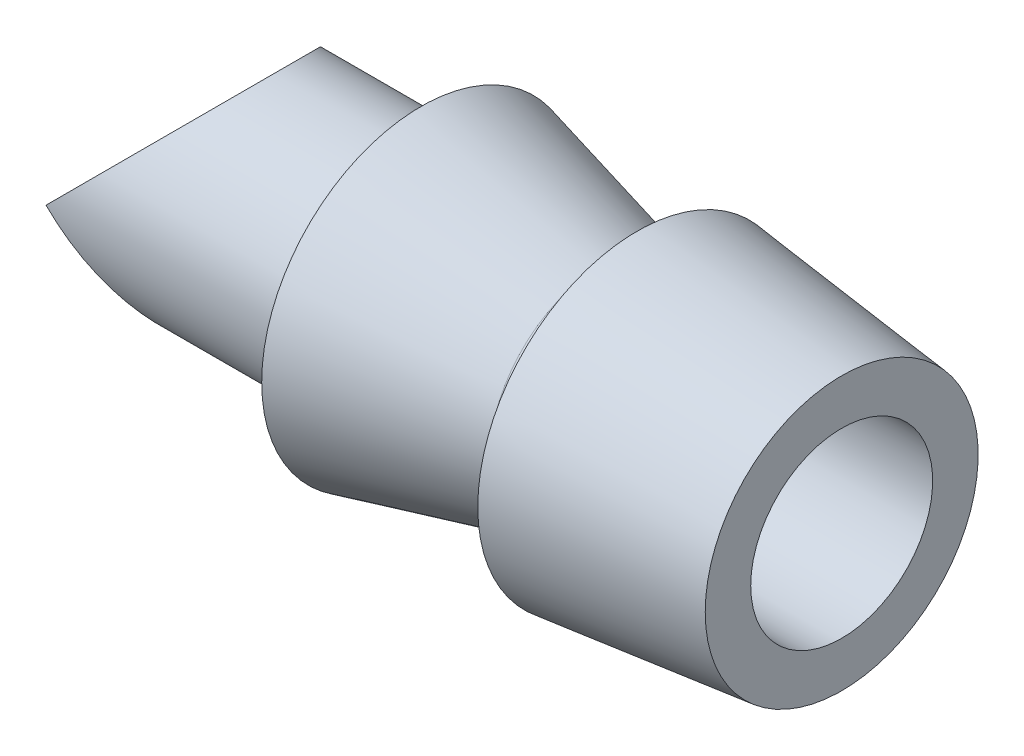
ISO-10303-21;
HEADER;
FILE_DESCRIPTION(('STEP AP214'),'2;1');
FILE_NAME('part.step','',(''),(''),'','','');
FILE_SCHEMA(('AUTOMOTIVE_DESIGN { 1 0 10303 214 1 1 1 1 }'));
ENDSEC;
DATA;
#1=APPLICATION_CONTEXT('core data for automotive mechanical design processes');
#2=APPLICATION_PROTOCOL_DEFINITION('international standard','automotive_design',2000,#1);
#3=PRODUCT_CONTEXT('',#1,'mechanical');
#4=PRODUCT('Part','Part','',(#3));
#5=PRODUCT_RELATED_PRODUCT_CATEGORY('part','',(#4));
#6=PRODUCT_DEFINITION_FORMATION('','',#4);
#7=PRODUCT_DEFINITION_CONTEXT('part definition',#1,'design');
#8=PRODUCT_DEFINITION('design','',#6,#7);
#9=PRODUCT_DEFINITION_SHAPE('','',#8);
#10=(LENGTH_UNIT() NAMED_UNIT(*) SI_UNIT(.MILLI.,.METRE.));
#11=(NAMED_UNIT(*) PLANE_ANGLE_UNIT() SI_UNIT($,.RADIAN.));
#12=(NAMED_UNIT(*) SI_UNIT($,.STERADIAN.) SOLID_ANGLE_UNIT());
#13=UNCERTAINTY_MEASURE_WITH_UNIT(LENGTH_MEASURE(1.E-05),#10,'distance_accuracy_value','');
#14=(GEOMETRIC_REPRESENTATION_CONTEXT(3) GLOBAL_UNCERTAINTY_ASSIGNED_CONTEXT((#13)) GLOBAL_UNIT_ASSIGNED_CONTEXT((#10,
#11,#12)) REPRESENTATION_CONTEXT('',''));
#15=CARTESIAN_POINT('',(0.,0.,0.));
#16=DIRECTION('',(0.,0.,1.));
#17=DIRECTION('',(1.,0.,0.));
#18=AXIS2_PLACEMENT_3D('',#15,#16,#17);
#19=CARTESIAN_POINT('',(0.,0.,0.));
#20=DIRECTION('',(-1.,0.,0.));
#21=DIRECTION('',(0.,0.,1.));
#22=AXIS2_PLACEMENT_3D('',#19,#20,#21);
#23=CYLINDRICAL_SURFACE('',#22,2.5);
#24=CARTESIAN_POINT('',(-4.35466522054894,0.,0.));
#25=DIRECTION('',(0.707106781186547,-0.707106781186547,0.));
#26=DIRECTION('',(-0.707106781186548,-0.707106781186548,0.));
#27=AXIS2_PLACEMENT_3D('',#24,#25,#26);
#28=ELLIPSE('',#27,3.53553390593274,2.5);
#29=CARTESIAN_POINT('',(-4.35466522054894,0.,-2.5));
#30=VERTEX_POINT('',#29);
#31=CARTESIAN_POINT('',(-4.35466522054894,0.,2.5));
#32=VERTEX_POINT('',#31);
#33=EDGE_CURVE('E71',#30,#32,#28,.T.);
#34=ORIENTED_EDGE('',*,*,#33,.T.);
#35=CARTESIAN_POINT('',(-4.35466522054894,0.,0.));
#36=DIRECTION('',(0.707106781186547,0.707106781186547,0.));
#37=DIRECTION('',(-0.707106781186548,0.707106781186548,0.));
#38=AXIS2_PLACEMENT_3D('',#35,#36,#37);
#39=ELLIPSE('',#38,3.53553390593274,2.5);
#40=EDGE_CURVE('E58',#32,#30,#39,.T.);
#41=ORIENTED_EDGE('',*,*,#40,.T.);
#42=EDGE_LOOP('',(#34,#41));
#43=FACE_BOUND('',#42,.T.);
#44=CARTESIAN_POINT('',(1.38699913001601,0.,0.));
#45=DIRECTION('',(-1.,0.,0.));
#46=DIRECTION('',(0.,0.,1.));
#47=AXIS2_PLACEMENT_3D('',#44,#45,#46);
#48=CIRCLE('',#47,2.5);
#49=CARTESIAN_POINT('',(1.38699913001601,0.,2.5));
#50=VERTEX_POINT('',#49);
#51=EDGE_CURVE('E51',#50,#50,#48,.T.);
#52=ORIENTED_EDGE('',*,*,#51,.T.);
#53=EDGE_LOOP('',(#52));
#54=FACE_BOUND('',#53,.T.);
#55=ADVANCED_FACE('F43',(#43,#54),#23,.T.);
#56=CARTESIAN_POINT('',(1.38699913001601,3.5,0.));
#57=DIRECTION('',(1.,0.,0.));
#58=DIRECTION('',(0.,0.,-1.));
#59=AXIS2_PLACEMENT_3D('',#56,#57,#58);
#60=PLANE('',#59);
#61=ORIENTED_EDGE('',*,*,#51,.F.);
#62=EDGE_LOOP('',(#61));
#63=FACE_BOUND('',#62,.T.);
#64=CARTESIAN_POINT('',(1.38699913001601,0.,0.));
#65=DIRECTION('',(-1.,0.,0.));
#66=DIRECTION('',(0.,0.,1.));
#67=AXIS2_PLACEMENT_3D('',#64,#65,#66);
#68=CIRCLE('',#67,3.5);
#69=CARTESIAN_POINT('',(1.38699913001601,0.,3.5));
#70=VERTEX_POINT('',#69);
#71=EDGE_CURVE('E106',#70,#70,#68,.T.);
#72=ORIENTED_EDGE('',*,*,#71,.T.);
#73=EDGE_LOOP('',(#72));
#74=FACE_BOUND('',#73,.T.);
#75=ADVANCED_FACE('F113',(#63,#74),#60,.F.);
#76=CARTESIAN_POINT('',(5.38699913001601,0.,0.));
#77=DIRECTION('',(-1.,0.,0.));
#78=DIRECTION('',(0.,0.,1.));
#79=AXIS2_PLACEMENT_3D('',#76,#77,#78);
#80=CONICAL_SURFACE('',#79,2.5,0.244978663126864);
#81=ORIENTED_EDGE('',*,*,#71,.F.);
#82=EDGE_LOOP('',(#81));
#83=FACE_BOUND('',#82,.T.);
#84=CARTESIAN_POINT('',(5.38699913001601,0.,0.));
#85=DIRECTION('',(-1.,0.,0.));
#86=DIRECTION('',(0.,0.,1.));
#87=AXIS2_PLACEMENT_3D('',#84,#85,#86);
#88=CIRCLE('',#87,2.5);
#89=CARTESIAN_POINT('',(5.38699913001601,0.,2.5));
#90=VERTEX_POINT('',#89);
#91=EDGE_CURVE('E102',#90,#90,#88,.T.);
#92=ORIENTED_EDGE('',*,*,#91,.T.);
#93=EDGE_LOOP('',(#92));
#94=FACE_BOUND('',#93,.T.);
#95=ADVANCED_FACE('F116',(#83,#94),#80,.T.);
#96=CARTESIAN_POINT('',(0.,0.,0.));
#97=DIRECTION('',(-1.,0.,0.));
#98=DIRECTION('',(0.,0.,1.));
#99=AXIS2_PLACEMENT_3D('',#96,#97,#98);
#100=CYLINDRICAL_SURFACE('',#99,2.5);
#101=ORIENTED_EDGE('',*,*,#91,.F.);
#102=EDGE_LOOP('',(#101));
#103=FACE_BOUND('',#102,.T.);
#104=CARTESIAN_POINT('',(6.13699913001601,0.,0.));
#105=DIRECTION('',(-1.,0.,0.));
#106=DIRECTION('',(0.,0.,1.));
#107=AXIS2_PLACEMENT_3D('',#104,#105,#106);
#108=CIRCLE('',#107,2.5);
#109=CARTESIAN_POINT('',(6.13699913001601,0.,2.5));
#110=VERTEX_POINT('',#109);
#111=EDGE_CURVE('E98',#110,#110,#108,.T.);
#112=ORIENTED_EDGE('',*,*,#111,.T.);
#113=EDGE_LOOP('',(#112));
#114=FACE_BOUND('',#113,.T.);
#115=ADVANCED_FACE('F121',(#103,#114),#100,.T.);
#116=CARTESIAN_POINT('',(6.13699913001601,3.5,0.));
#117=DIRECTION('',(1.,0.,0.));
#118=DIRECTION('',(0.,0.,-1.));
#119=AXIS2_PLACEMENT_3D('',#116,#117,#118);
#120=PLANE('',#119);
#121=ORIENTED_EDGE('',*,*,#111,.F.);
#122=EDGE_LOOP('',(#121));
#123=FACE_BOUND('',#122,.T.);
#124=CARTESIAN_POINT('',(6.13699913001601,0.,0.));
#125=DIRECTION('',(-1.,0.,0.));
#126=DIRECTION('',(0.,0.,1.));
#127=AXIS2_PLACEMENT_3D('',#124,#125,#126);
#128=CIRCLE('',#127,3.5);
#129=CARTESIAN_POINT('',(6.13699913001601,0.,3.5));
#130=VERTEX_POINT('',#129);
#131=EDGE_CURVE('E94',#130,#130,#128,.T.);
#132=ORIENTED_EDGE('',*,*,#131,.T.);
#133=EDGE_LOOP('',(#132));
#134=FACE_BOUND('',#133,.T.);
#135=ADVANCED_FACE('F127',(#123,#134),#120,.F.);
#136=CARTESIAN_POINT('',(10.636999130016,0.,0.));
#137=DIRECTION('',(-1.,0.,0.));
#138=DIRECTION('',(0.,0.,1.));
#139=AXIS2_PLACEMENT_3D('',#136,#137,#138);
#140=CONICAL_SURFACE('',#139,3.,0.110657221173896);
#141=ORIENTED_EDGE('',*,*,#131,.F.);
#142=EDGE_LOOP('',(#141));
#143=FACE_BOUND('',#142,.T.);
#144=CARTESIAN_POINT('',(10.636999130016,0.,0.));
#145=DIRECTION('',(-1.,0.,0.));
#146=DIRECTION('',(0.,0.,1.));
#147=AXIS2_PLACEMENT_3D('',#144,#145,#146);
#148=CIRCLE('',#147,3.);
#149=CARTESIAN_POINT('',(10.636999130016,0.,3.));
#150=VERTEX_POINT('',#149);
#151=EDGE_CURVE('E88',#150,#150,#148,.T.);
#152=ORIENTED_EDGE('',*,*,#151,.T.);
#153=EDGE_LOOP('',(#152));
#154=FACE_BOUND('',#153,.T.);
#155=ADVANCED_FACE('F133',(#143,#154),#140,.T.);
#156=CARTESIAN_POINT('',(10.636999130016,2.,0.));
#157=DIRECTION('',(-1.,0.,0.));
#158=DIRECTION('',(0.,0.,1.));
#159=AXIS2_PLACEMENT_3D('',#156,#157,#158);
#160=PLANE('',#159);
#161=ORIENTED_EDGE('',*,*,#151,.F.);
#162=EDGE_LOOP('',(#161));
#163=FACE_BOUND('',#162,.T.);
#164=CARTESIAN_POINT('',(10.636999130016,0.,0.));
#165=DIRECTION('',(-1.,0.,0.));
#166=DIRECTION('',(0.,0.,1.));
#167=AXIS2_PLACEMENT_3D('',#164,#165,#166);
#168=CIRCLE('',#167,2.);
#169=CARTESIAN_POINT('',(10.636999130016,0.,2.));
#170=VERTEX_POINT('',#169);
#171=EDGE_CURVE('E84',#170,#170,#168,.T.);
#172=ORIENTED_EDGE('',*,*,#171,.T.);
#173=EDGE_LOOP('',(#172));
#174=FACE_BOUND('',#173,.T.);
#175=ADVANCED_FACE('F139',(#163,#174),#160,.F.);
#176=CARTESIAN_POINT('',(0.,0.,0.));
#177=DIRECTION('',(-1.,0.,0.));
#178=DIRECTION('',(0.,0.,1.));
#179=AXIS2_PLACEMENT_3D('',#176,#177,#178);
#180=CYLINDRICAL_SURFACE('',#179,2.);
#181=ORIENTED_EDGE('',*,*,#171,.F.);
#182=EDGE_LOOP('',(#181));
#183=FACE_BOUND('',#182,.T.);
#184=CARTESIAN_POINT('',(-4.35466522054894,0.,0.));
#185=DIRECTION('',(0.707106781186547,-0.707106781186547,0.));
#186=DIRECTION('',(-0.707106781186548,-0.707106781186548,0.));
#187=AXIS2_PLACEMENT_3D('',#184,#185,#186);
#188=ELLIPSE('',#187,2.82842712474619,2.);
#189=CARTESIAN_POINT('',(-4.35466522054894,0.,2.));
#190=VERTEX_POINT('',#189);
#191=CARTESIAN_POINT('',(-4.35466522054894,0.,-2.));
#192=VERTEX_POINT('',#191);
#193=EDGE_CURVE('E11',#190,#192,#188,.F.);
#194=ORIENTED_EDGE('',*,*,#193,.T.);
#195=CARTESIAN_POINT('',(-4.35466522054894,0.,0.));
#196=DIRECTION('',(0.707106781186547,0.707106781186547,0.));
#197=DIRECTION('',(-0.707106781186548,0.707106781186548,0.));
#198=AXIS2_PLACEMENT_3D('',#195,#196,#197);
#199=ELLIPSE('',#198,2.82842712474619,2.);
#200=EDGE_CURVE('E73',#192,#190,#199,.F.);
#201=ORIENTED_EDGE('',*,*,#200,.T.);
#202=EDGE_LOOP('',(#194,#201));
#203=FACE_BOUND('',#202,.T.);
#204=ADVANCED_FACE('F145',(#183,#203),#180,.F.);
#205=CARTESIAN_POINT('',(-2.17733261027447,2.17733261027447,-3.5));
#206=DIRECTION('',(0.707106781186547,-0.707106781186547,0.));
#207=DIRECTION('',(0.707106781186548,0.707106781186548,0.));
#208=AXIS2_PLACEMENT_3D('',#205,#206,#207);
#209=PLANE('',#208);
#210=DIRECTION('',(0.,0.,1.));
#211=VECTOR('',#210,1.);
#212=CARTESIAN_POINT('',(-4.35466522054894,0.,-3.5));
#213=LINE('',#212,#211);
#214=EDGE_CURVE('E76',#30,#192,#213,.T.);
#215=ORIENTED_EDGE('',*,*,#214,.T.);
#216=ORIENTED_EDGE('',*,*,#193,.F.);
#217=EDGE_CURVE('E63',#190,#32,#213,.T.);
#218=ORIENTED_EDGE('',*,*,#217,.T.);
#219=ORIENTED_EDGE('',*,*,#33,.F.);
#220=EDGE_LOOP('',(#215,#216,#218,#219));
#221=FACE_BOUND('',#220,.T.);
#222=ADVANCED_FACE('F82',(#221),#209,.F.);
#223=CARTESIAN_POINT('',(-2.17733261027447,-2.17733261027447,-3.5));
#224=DIRECTION('',(0.707106781186547,0.707106781186547,0.));
#225=DIRECTION('',(-0.707106781186548,0.707106781186548,0.));
#226=AXIS2_PLACEMENT_3D('',#223,#224,#225);
#227=PLANE('',#226);
#228=ORIENTED_EDGE('',*,*,#217,.F.);
#229=ORIENTED_EDGE('',*,*,#200,.F.);
#230=ORIENTED_EDGE('',*,*,#214,.F.);
#231=ORIENTED_EDGE('',*,*,#40,.F.);
#232=EDGE_LOOP('',(#228,#229,#230,#231));
#233=FACE_BOUND('',#232,.T.);
#234=ADVANCED_FACE('F77',(#233),#227,.F.);
#235=CLOSED_SHELL('',(#55,#75,#95,#115,#135,#155,#175,#204,#222,#234));
#236=MANIFOLD_SOLID_BREP('B2',#235);
#237=ADVANCED_BREP_SHAPE_REPRESENTATION('',(#18,#236),#14);
#238=SHAPE_DEFINITION_REPRESENTATION(#9,#237);
ENDSEC;
END-ISO-10303-21;
